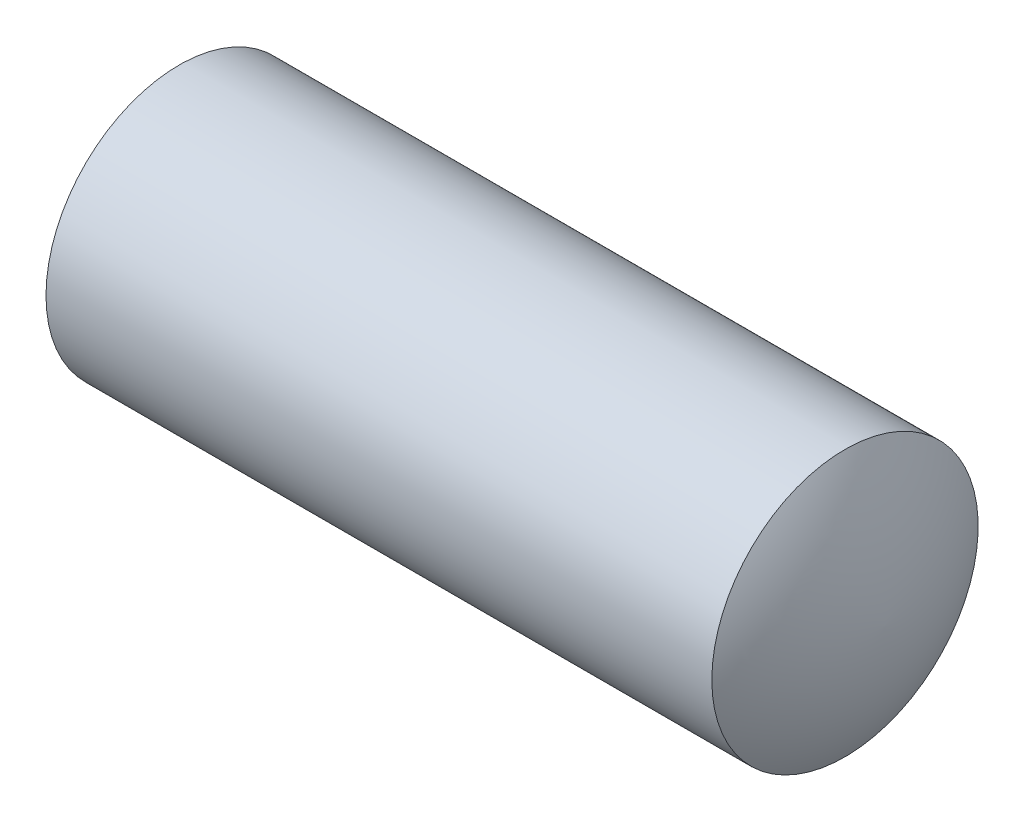
ISO-10303-21;
HEADER;
FILE_DESCRIPTION(('STEP AP214'),'2;1');
FILE_NAME('part.step','',(''),(''),'','','');
FILE_SCHEMA(('AUTOMOTIVE_DESIGN { 1 0 10303 214 1 1 1 1 }'));
ENDSEC;
DATA;
#1=APPLICATION_CONTEXT('core data for automotive mechanical design processes');
#2=APPLICATION_PROTOCOL_DEFINITION('international standard','automotive_design',2000,#1);
#3=PRODUCT_CONTEXT('',#1,'mechanical');
#4=PRODUCT('Part','Part','',(#3));
#5=PRODUCT_RELATED_PRODUCT_CATEGORY('part','',(#4));
#6=PRODUCT_DEFINITION_FORMATION('','',#4);
#7=PRODUCT_DEFINITION_CONTEXT('part definition',#1,'design');
#8=PRODUCT_DEFINITION('design','',#6,#7);
#9=PRODUCT_DEFINITION_SHAPE('','',#8);
#10=(LENGTH_UNIT() NAMED_UNIT(*) SI_UNIT(.MILLI.,.METRE.));
#11=(NAMED_UNIT(*) PLANE_ANGLE_UNIT() SI_UNIT($,.RADIAN.));
#12=(NAMED_UNIT(*) SI_UNIT($,.STERADIAN.) SOLID_ANGLE_UNIT());
#13=UNCERTAINTY_MEASURE_WITH_UNIT(LENGTH_MEASURE(1.E-05),#10,'distance_accuracy_value','');
#14=(GEOMETRIC_REPRESENTATION_CONTEXT(3) GLOBAL_UNCERTAINTY_ASSIGNED_CONTEXT((#13)) GLOBAL_UNIT_ASSIGNED_CONTEXT((#10,
#11,#12)) REPRESENTATION_CONTEXT('',''));
#15=CARTESIAN_POINT('',(0.,0.,0.));
#16=DIRECTION('',(0.,0.,1.));
#17=DIRECTION('',(1.,0.,0.));
#18=AXIS2_PLACEMENT_3D('',#15,#16,#17);
#19=CARTESIAN_POINT('',(3.39849957179514,0.,-0.109549871538541));
#20=DIRECTION('',(0.,-1.,0.));
#21=DIRECTION('',(0.,0.,1.));
#22=AXIS2_PLACEMENT_3D('',#19,#20,#21);
#23=CIRCLE('',#22,4.);
#24=TRIMMED_CURVE('',#23,(PARAMETER_VALUE(-1.5434054339856)),(PARAMETER_VALUE(1.5434054339856)),
.T.,.PARAMETER.);
#25=CARTESIAN_POINT('',(3.39849957179514,0.,0.));
#26=DIRECTION('',(-1.,0.,0.));
#27=AXIS1_PLACEMENT('',#25,#26);
#28=SURFACE_OF_REVOLUTION('',#24,#27);
#29=CARTESIAN_POINT('',(-0.6,0.,0.));
#30=VERTEX_POINT('',#29);
#31=VERTEX_LOOP('',#30);
#32=FACE_BOUND('',#31,.T.);
#33=CARTESIAN_POINT('',(0.,0.,0.));
#34=DIRECTION('',(-1.,0.,0.));
#35=DIRECTION('',(0.,0.,1.));
#36=AXIS2_PLACEMENT_3D('',#33,#34,#35);
#37=CIRCLE('',#36,2.);
#38=CARTESIAN_POINT('',(0.,0.,2.));
#39=VERTEX_POINT('',#38);
#40=EDGE_CURVE('E44',#39,#39,#37,.T.);
#41=ORIENTED_EDGE('',*,*,#40,.T.);
#42=EDGE_LOOP('',(#41));
#43=FACE_BOUND('',#42,.T.);
#44=ADVANCED_FACE('F37',(#32,#43),#28,.T.);
#45=CARTESIAN_POINT('',(6.60150042820487,0.,-0.109549871538546));
#46=DIRECTION('',(0.,-1.,0.));
#47=DIRECTION('',(0.,0.,1.));
#48=AXIS2_PLACEMENT_3D('',#45,#46,#47);
#49=CIRCLE('',#48,4.);
#50=TRIMMED_CURVE('',#49,(PARAMETER_VALUE(-1.5434054339856)),(PARAMETER_VALUE(1.5434054339856)),
.T.,.PARAMETER.);
#51=CARTESIAN_POINT('',(6.60150042820487,0.,0.));
#52=DIRECTION('',(-1.,0.,0.));
#53=AXIS1_PLACEMENT('',#51,#52);
#54=SURFACE_OF_REVOLUTION('',#50,#53);
#55=CARTESIAN_POINT('',(10.,0.,0.));
#56=DIRECTION('',(-1.,0.,0.));
#57=DIRECTION('',(0.,0.,1.));
#58=AXIS2_PLACEMENT_3D('',#55,#56,#57);
#59=CIRCLE('',#58,2.);
#60=CARTESIAN_POINT('',(10.,0.,2.));
#61=VERTEX_POINT('',#60);
#62=EDGE_CURVE('E11',#61,#61,#59,.T.);
#63=ORIENTED_EDGE('',*,*,#62,.F.);
#64=EDGE_LOOP('',(#63));
#65=FACE_BOUND('',#64,.T.);
#66=CARTESIAN_POINT('',(10.6,0.,0.));
#67=VERTEX_POINT('',#66);
#68=VERTEX_LOOP('',#67);
#69=FACE_BOUND('',#68,.T.);
#70=ADVANCED_FACE('F52',(#65,#69),#54,.T.);
#71=CARTESIAN_POINT('',(0.,0.,0.));
#72=DIRECTION('',(-1.,0.,0.));
#73=DIRECTION('',(0.,0.,1.));
#74=AXIS2_PLACEMENT_3D('',#71,#72,#73);
#75=CYLINDRICAL_SURFACE('',#74,2.);
#76=ORIENTED_EDGE('',*,*,#40,.F.);
#77=EDGE_LOOP('',(#76));
#78=FACE_BOUND('',#77,.T.);
#79=ORIENTED_EDGE('',*,*,#62,.T.);
#80=EDGE_LOOP('',(#79));
#81=FACE_BOUND('',#80,.T.);
#82=ADVANCED_FACE('F56',(#78,#81),#75,.T.);
#83=CLOSED_SHELL('',(#44,#70,#82));
#84=MANIFOLD_SOLID_BREP('B2',#83);
#85=ADVANCED_BREP_SHAPE_REPRESENTATION('',(#18,#84),#14);
#86=SHAPE_DEFINITION_REPRESENTATION(#9,#85);
ENDSEC;
END-ISO-10303-21;
